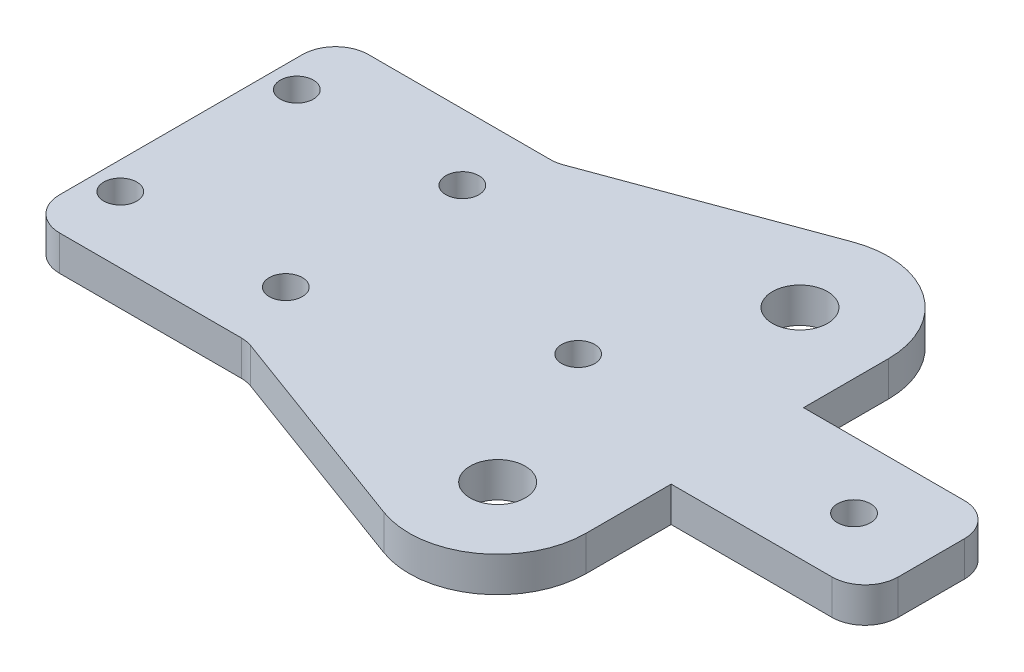
ISO-10303-21;
HEADER;
FILE_DESCRIPTION(('STEP AP214'),'2;1');
FILE_NAME('part.step','',(''),(''),'','','');
FILE_SCHEMA(('AUTOMOTIVE_DESIGN { 1 0 10303 214 1 1 1 1 }'));
ENDSEC;
DATA;
#1=APPLICATION_CONTEXT('core data for automotive mechanical design processes');
#2=APPLICATION_PROTOCOL_DEFINITION('international standard','automotive_design',2000,#1);
#3=PRODUCT_CONTEXT('',#1,'mechanical');
#4=PRODUCT('Part','Part','',(#3));
#5=PRODUCT_RELATED_PRODUCT_CATEGORY('part','',(#4));
#6=PRODUCT_DEFINITION_FORMATION('','',#4);
#7=PRODUCT_DEFINITION_CONTEXT('part definition',#1,'design');
#8=PRODUCT_DEFINITION('design','',#6,#7);
#9=PRODUCT_DEFINITION_SHAPE('','',#8);
#10=(LENGTH_UNIT() NAMED_UNIT(*) SI_UNIT(.MILLI.,.METRE.));
#11=(NAMED_UNIT(*) PLANE_ANGLE_UNIT() SI_UNIT($,.RADIAN.));
#12=(NAMED_UNIT(*) SI_UNIT($,.STERADIAN.) SOLID_ANGLE_UNIT());
#13=UNCERTAINTY_MEASURE_WITH_UNIT(LENGTH_MEASURE(1.E-05),#10,'distance_accuracy_value','');
#14=(GEOMETRIC_REPRESENTATION_CONTEXT(3) GLOBAL_UNCERTAINTY_ASSIGNED_CONTEXT((#13)) GLOBAL_UNIT_ASSIGNED_CONTEXT((#10,
#11,#12)) REPRESENTATION_CONTEXT('',''));
#15=CARTESIAN_POINT('',(0.,0.,0.));
#16=DIRECTION('',(0.,0.,1.));
#17=DIRECTION('',(1.,0.,0.));
#18=AXIS2_PLACEMENT_3D('',#15,#16,#17);
#19=CARTESIAN_POINT('',(42.4,3.175,-13.7));
#20=DIRECTION('',(0.,1.,0.));
#21=DIRECTION('',(0.,0.,1.));
#22=AXIS2_PLACEMENT_3D('',#19,#20,#21);
#23=PLANE('',#22);
#24=CARTESIAN_POINT('',(36.,3.175,0.));
#25=DIRECTION('',(0.,1.,0.));
#26=DIRECTION('',(0.,0.,1.));
#27=AXIS2_PLACEMENT_3D('',#24,#25,#26);
#28=CIRCLE('',#27,1.5);
#29=CARTESIAN_POINT('',(36.,3.175,1.5));
#30=VERTEX_POINT('',#29);
#31=EDGE_CURVE('E361',#30,#30,#28,.T.);
#32=ORIENTED_EDGE('',*,*,#31,.F.);
#33=EDGE_LOOP('',(#32));
#34=FACE_BOUND('',#33,.T.);
#35=CARTESIAN_POINT('',(2.5,3.175,8.));
#36=DIRECTION('',(0.,1.,0.));
#37=DIRECTION('',(0.,0.,1.));
#38=AXIS2_PLACEMENT_3D('',#35,#36,#37);
#39=CIRCLE('',#38,1.5);
#40=CARTESIAN_POINT('',(2.5,3.175,9.5));
#41=VERTEX_POINT('',#40);
#42=EDGE_CURVE('E349',#41,#41,#39,.T.);
#43=ORIENTED_EDGE('',*,*,#42,.F.);
#44=EDGE_LOOP('',(#43));
#45=FACE_BOUND('',#44,.T.);
#46=CARTESIAN_POINT('',(17.5,3.175,-8.));
#47=DIRECTION('',(0.,1.,0.));
#48=DIRECTION('',(0.,0.,1.));
#49=AXIS2_PLACEMENT_3D('',#46,#47,#48);
#50=CIRCLE('',#49,1.5);
#51=CARTESIAN_POINT('',(17.5,3.175,-6.5));
#52=VERTEX_POINT('',#51);
#53=EDGE_CURVE('E337',#52,#52,#50,.T.);
#54=ORIENTED_EDGE('',*,*,#53,.F.);
#55=EDGE_LOOP('',(#54));
#56=FACE_BOUND('',#55,.T.);
#57=CARTESIAN_POINT('',(42.4,3.175,-13.7));
#58=DIRECTION('',(0.,1.,0.));
#59=DIRECTION('',(0.,0.,1.));
#60=AXIS2_PLACEMENT_3D('',#57,#58,#59);
#61=CIRCLE('',#60,2.5);
#62=CARTESIAN_POINT('',(42.4,3.175,-11.2));
#63=VERTEX_POINT('',#62);
#64=EDGE_CURVE('E212',#63,#63,#61,.T.);
#65=ORIENTED_EDGE('',*,*,#64,.F.);
#66=EDGE_LOOP('',(#65));
#67=FACE_BOUND('',#66,.T.);
#68=DIRECTION('',(0.,0.,-1.));
#69=VECTOR('',#68,1.);
#70=CARTESIAN_POINT('',(68.,3.175,-6.));
#71=LINE('',#70,#69);
#72=CARTESIAN_POINT('',(68.,3.175,3.));
#73=VERTEX_POINT('',#72);
#74=CARTESIAN_POINT('',(68.,3.175,-3.));
#75=VERTEX_POINT('',#74);
#76=EDGE_CURVE('E193',#73,#75,#71,.T.);
#77=ORIENTED_EDGE('',*,*,#76,.T.);
#78=CARTESIAN_POINT('',(65.,3.175,-3.));
#79=DIRECTION('',(0.,1.,0.));
#80=DIRECTION('',(0.,0.,1.));
#81=AXIS2_PLACEMENT_3D('',#78,#79,#80);
#82=CIRCLE('',#81,3.);
#83=CARTESIAN_POINT('',(65.,3.175,-6.));
#84=VERTEX_POINT('',#83);
#85=EDGE_CURVE('E270',#75,#84,#82,.T.);
#86=ORIENTED_EDGE('',*,*,#85,.T.);
#87=DIRECTION('',(-1.,0.,0.));
#88=VECTOR('',#87,1.);
#89=CARTESIAN_POINT('',(68.,3.175,-6.));
#90=LINE('',#89,#88);
#91=CARTESIAN_POINT('',(50.425,3.175,-6.));
#92=VERTEX_POINT('',#91);
#93=EDGE_CURVE('E195',#84,#92,#90,.T.);
#94=ORIENTED_EDGE('',*,*,#93,.T.);
#95=DIRECTION('',(0.,0.,-1.));
#96=VECTOR('',#95,1.);
#97=CARTESIAN_POINT('',(50.425,3.175,-13.7));
#98=LINE('',#97,#96);
#99=CARTESIAN_POINT('',(50.425,3.175,-13.7));
#100=VERTEX_POINT('',#99);
#101=EDGE_CURVE('E197',#92,#100,#98,.T.);
#102=ORIENTED_EDGE('',*,*,#101,.T.);
#103=CARTESIAN_POINT('',(42.4,3.175,-13.7));
#104=DIRECTION('',(0.,1.,0.));
#105=DIRECTION('',(0.,0.,1.));
#106=AXIS2_PLACEMENT_3D('',#103,#104,#105);
#107=CIRCLE('',#106,8.025);
#108=CARTESIAN_POINT('',(39.6258235763295,3.175,-21.230243699267));
#109=VERTEX_POINT('',#108);
#110=EDGE_CURVE('E199',#100,#109,#107,.T.);
#111=ORIENTED_EDGE('',*,*,#110,.T.);
#112=DIRECTION('',(-0.938348124519254,0.,0.345691766189474));
#113=VECTOR('',#112,1.);
#114=CARTESIAN_POINT('',(20.,3.175,-14.));
#115=LINE('',#114,#113);
#116=CARTESIAN_POINT('',(20.5020448334781,3.175,-14.1849556264422));
#117=VERTEX_POINT('',#116);
#118=EDGE_CURVE('E201',#109,#117,#115,.T.);
#119=ORIENTED_EDGE('',*,*,#118,.T.);
#120=CARTESIAN_POINT('',(19.4649695349097,3.175,-17.));
#121=DIRECTION('',(0.,1.,0.));
#122=DIRECTION('',(0.,0.,1.));
#123=AXIS2_PLACEMENT_3D('',#120,#121,#122);
#124=CIRCLE('',#123,3.);
#125=CARTESIAN_POINT('',(19.4649695349097,3.175,-14.));
#126=VERTEX_POINT('',#125);
#127=EDGE_CURVE('E11',#117,#126,#124,.F.);
#128=ORIENTED_EDGE('',*,*,#127,.T.);
#129=DIRECTION('',(-1.,0.,0.));
#130=VECTOR('',#129,1.);
#131=CARTESIAN_POINT('',(0.,3.175,-14.));
#132=LINE('',#131,#130);
#133=CARTESIAN_POINT('',(3.,3.175,-14.));
#134=VERTEX_POINT('',#133);
#135=EDGE_CURVE('E204',#126,#134,#132,.T.);
#136=ORIENTED_EDGE('',*,*,#135,.T.);
#137=CARTESIAN_POINT('',(3.,3.175,-11.));
#138=DIRECTION('',(0.,1.,0.));
#139=DIRECTION('',(0.,0.,1.));
#140=AXIS2_PLACEMENT_3D('',#137,#138,#139);
#141=CIRCLE('',#140,3.);
#142=CARTESIAN_POINT('',(0.,3.175,-11.));
#143=VERTEX_POINT('',#142);
#144=EDGE_CURVE('E55',#134,#143,#141,.T.);
#145=ORIENTED_EDGE('',*,*,#144,.T.);
#146=DIRECTION('',(0.,0.,1.));
#147=VECTOR('',#146,1.);
#148=CARTESIAN_POINT('',(0.,3.175,14.));
#149=LINE('',#148,#147);
#150=CARTESIAN_POINT('',(0.,3.175,11.));
#151=VERTEX_POINT('',#150);
#152=EDGE_CURVE('E206',#143,#151,#149,.T.);
#153=ORIENTED_EDGE('',*,*,#152,.T.);
#154=CARTESIAN_POINT('',(3.,3.175,11.));
#155=DIRECTION('',(0.,1.,0.));
#156=DIRECTION('',(0.,0.,1.));
#157=AXIS2_PLACEMENT_3D('',#154,#155,#156);
#158=CIRCLE('',#157,3.);
#159=CARTESIAN_POINT('',(3.,3.175,14.));
#160=VERTEX_POINT('',#159);
#161=EDGE_CURVE('E266',#151,#160,#158,.T.);
#162=ORIENTED_EDGE('',*,*,#161,.T.);
#163=DIRECTION('',(1.,0.,0.));
#164=VECTOR('',#163,1.);
#165=CARTESIAN_POINT('',(20.,3.175,14.));
#166=LINE('',#165,#164);
#167=CARTESIAN_POINT('',(19.4649695349097,3.175,14.));
#168=VERTEX_POINT('',#167);
#169=EDGE_CURVE('E170',#160,#168,#166,.T.);
#170=ORIENTED_EDGE('',*,*,#169,.T.);
#171=CARTESIAN_POINT('',(19.4649695349097,3.175,17.));
#172=DIRECTION('',(0.,1.,0.));
#173=DIRECTION('',(0.,0.,1.));
#174=AXIS2_PLACEMENT_3D('',#171,#172,#173);
#175=CIRCLE('',#174,3.);
#176=CARTESIAN_POINT('',(20.5020448334781,3.175,14.1849556264422));
#177=VERTEX_POINT('',#176);
#178=EDGE_CURVE('E166',#168,#177,#175,.F.);
#179=ORIENTED_EDGE('',*,*,#178,.T.);
#180=DIRECTION('',(0.938348124519254,0.,0.345691766189474));
#181=VECTOR('',#180,1.);
#182=CARTESIAN_POINT('',(20.,3.175,14.));
#183=LINE('',#182,#181);
#184=CARTESIAN_POINT('',(39.6258235763295,3.175,21.230243699267));
#185=VERTEX_POINT('',#184);
#186=EDGE_CURVE('E157',#177,#185,#183,.T.);
#187=ORIENTED_EDGE('',*,*,#186,.T.);
#188=CARTESIAN_POINT('',(42.4,3.175,13.7));
#189=DIRECTION('',(0.,1.,0.));
#190=DIRECTION('',(0.,0.,-1.));
#191=AXIS2_PLACEMENT_3D('',#188,#189,#190);
#192=CIRCLE('',#191,8.025);
#193=CARTESIAN_POINT('',(50.425,3.175,13.7));
#194=VERTEX_POINT('',#193);
#195=EDGE_CURVE('E162',#185,#194,#192,.T.);
#196=ORIENTED_EDGE('',*,*,#195,.T.);
#197=DIRECTION('',(0.,0.,-1.));
#198=VECTOR('',#197,1.);
#199=CARTESIAN_POINT('',(50.425,3.175,6.));
#200=LINE('',#199,#198);
#201=CARTESIAN_POINT('',(50.425,3.175,6.));
#202=VERTEX_POINT('',#201);
#203=EDGE_CURVE('E185',#194,#202,#200,.T.);
#204=ORIENTED_EDGE('',*,*,#203,.T.);
#205=DIRECTION('',(1.,0.,0.));
#206=VECTOR('',#205,1.);
#207=CARTESIAN_POINT('',(68.,3.175,6.));
#208=LINE('',#207,#206);
#209=CARTESIAN_POINT('',(65.,3.175,6.));
#210=VERTEX_POINT('',#209);
#211=EDGE_CURVE('E187',#202,#210,#208,.T.);
#212=ORIENTED_EDGE('',*,*,#211,.T.);
#213=CARTESIAN_POINT('',(65.,3.175,3.));
#214=DIRECTION('',(0.,1.,0.));
#215=DIRECTION('',(0.,0.,1.));
#216=AXIS2_PLACEMENT_3D('',#213,#214,#215);
#217=CIRCLE('',#216,3.);
#218=EDGE_CURVE('E268',#210,#73,#217,.T.);
#219=ORIENTED_EDGE('',*,*,#218,.T.);
#220=EDGE_LOOP('',(#77,#86,#94,#102,#111,#119,#128,#136,#145,#153,#162,#170,#179,#187,#196,#204,
#212,#219));
#221=FACE_BOUND('',#220,.T.);
#222=CARTESIAN_POINT('',(2.5,3.175,-8.));
#223=DIRECTION('',(0.,1.,0.));
#224=DIRECTION('',(0.,0.,1.));
#225=AXIS2_PLACEMENT_3D('',#222,#223,#224);
#226=CIRCLE('',#225,1.5);
#227=CARTESIAN_POINT('',(2.5,3.175,-6.5));
#228=VERTEX_POINT('',#227);
#229=EDGE_CURVE('E331',#228,#228,#226,.T.);
#230=ORIENTED_EDGE('',*,*,#229,.F.);
#231=EDGE_LOOP('',(#230));
#232=FACE_BOUND('',#231,.T.);
#233=CARTESIAN_POINT('',(17.5,3.175,8.));
#234=DIRECTION('',(0.,1.,0.));
#235=DIRECTION('',(0.,0.,1.));
#236=AXIS2_PLACEMENT_3D('',#233,#234,#235);
#237=CIRCLE('',#236,1.5);
#238=CARTESIAN_POINT('',(17.5,3.175,9.5));
#239=VERTEX_POINT('',#238);
#240=EDGE_CURVE('E343',#239,#239,#237,.T.);
#241=ORIENTED_EDGE('',*,*,#240,.F.);
#242=EDGE_LOOP('',(#241));
#243=FACE_BOUND('',#242,.T.);
#244=CARTESIAN_POINT('',(42.4,3.175,13.7));
#245=DIRECTION('',(0.,1.,0.));
#246=DIRECTION('',(0.,0.,-1.));
#247=AXIS2_PLACEMENT_3D('',#244,#245,#246);
#248=CIRCLE('',#247,2.5);
#249=CARTESIAN_POINT('',(42.4,3.175,11.2));
#250=VERTEX_POINT('',#249);
#251=EDGE_CURVE('E355',#250,#250,#248,.T.);
#252=ORIENTED_EDGE('',*,*,#251,.F.);
#253=EDGE_LOOP('',(#252));
#254=FACE_BOUND('',#253,.T.);
#255=CARTESIAN_POINT('',(61.,3.175,0.));
#256=DIRECTION('',(0.,1.,0.));
#257=DIRECTION('',(0.,0.,1.));
#258=AXIS2_PLACEMENT_3D('',#255,#256,#257);
#259=CIRCLE('',#258,1.5);
#260=CARTESIAN_POINT('',(61.,3.175,1.5));
#261=VERTEX_POINT('',#260);
#262=EDGE_CURVE('E367',#261,#261,#259,.T.);
#263=ORIENTED_EDGE('',*,*,#262,.F.);
#264=EDGE_LOOP('',(#263));
#265=FACE_BOUND('',#264,.T.);
#266=ADVANCED_FACE('F33',(#34,#45,#56,#67,#221,#232,#243,#254,#265),#23,.T.);
#267=CARTESIAN_POINT('',(42.4,0.,-13.7));
#268=DIRECTION('',(0.,1.,0.));
#269=DIRECTION('',(0.,0.,1.));
#270=AXIS2_PLACEMENT_3D('',#267,#268,#269);
#271=PLANE('',#270);
#272=DIRECTION('',(-1.,0.,0.));
#273=VECTOR('',#272,1.);
#274=CARTESIAN_POINT('',(68.,0.,-6.));
#275=LINE('',#274,#273);
#276=CARTESIAN_POINT('',(65.,0.,-6.));
#277=VERTEX_POINT('',#276);
#278=CARTESIAN_POINT('',(50.425,0.,-6.));
#279=VERTEX_POINT('',#278);
#280=EDGE_CURVE('E224',#277,#279,#275,.T.);
#281=ORIENTED_EDGE('',*,*,#280,.F.);
#282=CARTESIAN_POINT('',(65.,0.,-3.));
#283=DIRECTION('',(0.,1.,0.));
#284=DIRECTION('',(0.,0.,1.));
#285=AXIS2_PLACEMENT_3D('',#282,#283,#284);
#286=CIRCLE('',#285,3.);
#287=CARTESIAN_POINT('',(68.,0.,-3.));
#288=VERTEX_POINT('',#287);
#289=EDGE_CURVE('E258',#277,#288,#286,.F.);
#290=ORIENTED_EDGE('',*,*,#289,.T.);
#291=DIRECTION('',(0.,0.,-1.));
#292=VECTOR('',#291,1.);
#293=CARTESIAN_POINT('',(68.,0.,-6.));
#294=LINE('',#293,#292);
#295=CARTESIAN_POINT('',(68.,0.,3.));
#296=VERTEX_POINT('',#295);
#297=EDGE_CURVE('E221',#296,#288,#294,.T.);
#298=ORIENTED_EDGE('',*,*,#297,.F.);
#299=CARTESIAN_POINT('',(65.,0.,3.));
#300=DIRECTION('',(0.,1.,0.));
#301=DIRECTION('',(0.,0.,1.));
#302=AXIS2_PLACEMENT_3D('',#299,#300,#301);
#303=CIRCLE('',#302,3.);
#304=CARTESIAN_POINT('',(65.,0.,6.));
#305=VERTEX_POINT('',#304);
#306=EDGE_CURVE('E256',#296,#305,#303,.F.);
#307=ORIENTED_EDGE('',*,*,#306,.T.);
#308=DIRECTION('',(1.,0.,0.));
#309=VECTOR('',#308,1.);
#310=CARTESIAN_POINT('',(68.,0.,6.));
#311=LINE('',#310,#309);
#312=CARTESIAN_POINT('',(50.425,0.,6.));
#313=VERTEX_POINT('',#312);
#314=EDGE_CURVE('E218',#313,#305,#311,.T.);
#315=ORIENTED_EDGE('',*,*,#314,.F.);
#316=DIRECTION('',(0.,0.,-1.));
#317=VECTOR('',#316,1.);
#318=CARTESIAN_POINT('',(50.425,0.,6.));
#319=LINE('',#318,#317);
#320=CARTESIAN_POINT('',(50.425,0.,13.7));
#321=VERTEX_POINT('',#320);
#322=EDGE_CURVE('E216',#321,#313,#319,.T.);
#323=ORIENTED_EDGE('',*,*,#322,.F.);
#324=CARTESIAN_POINT('',(42.4,0.,13.7));
#325=DIRECTION('',(0.,1.,0.));
#326=DIRECTION('',(0.,0.,-1.));
#327=AXIS2_PLACEMENT_3D('',#324,#325,#326);
#328=CIRCLE('',#327,8.025);
#329=CARTESIAN_POINT('',(39.6258235763295,0.,21.230243699267));
#330=VERTEX_POINT('',#329);
#331=EDGE_CURVE('E214',#330,#321,#328,.T.);
#332=ORIENTED_EDGE('',*,*,#331,.F.);
#333=DIRECTION('',(0.938348124519254,0.,0.345691766189474));
#334=VECTOR('',#333,1.);
#335=CARTESIAN_POINT('',(20.,0.,14.));
#336=LINE('',#335,#334);
#337=CARTESIAN_POINT('',(20.5020448334781,0.,14.1849556264422));
#338=VERTEX_POINT('',#337);
#339=EDGE_CURVE('E176',#338,#330,#336,.T.);
#340=ORIENTED_EDGE('',*,*,#339,.F.);
#341=CARTESIAN_POINT('',(19.4649695349097,0.,17.));
#342=DIRECTION('',(0.,1.,0.));
#343=DIRECTION('',(0.,0.,1.));
#344=AXIS2_PLACEMENT_3D('',#341,#342,#343);
#345=CIRCLE('',#344,3.);
#346=CARTESIAN_POINT('',(19.4649695349097,0.,14.));
#347=VERTEX_POINT('',#346);
#348=EDGE_CURVE('E292',#338,#347,#345,.T.);
#349=ORIENTED_EDGE('',*,*,#348,.T.);
#350=DIRECTION('',(1.,0.,0.));
#351=VECTOR('',#350,1.);
#352=CARTESIAN_POINT('',(20.,0.,14.));
#353=LINE('',#352,#351);
#354=CARTESIAN_POINT('',(3.,0.,14.));
#355=VERTEX_POINT('',#354);
#356=EDGE_CURVE('E209',#355,#347,#353,.T.);
#357=ORIENTED_EDGE('',*,*,#356,.F.);
#358=CARTESIAN_POINT('',(3.,0.,11.));
#359=DIRECTION('',(0.,1.,0.));
#360=DIRECTION('',(0.,0.,1.));
#361=AXIS2_PLACEMENT_3D('',#358,#359,#360);
#362=CIRCLE('',#361,3.);
#363=CARTESIAN_POINT('',(0.,0.,11.));
#364=VERTEX_POINT('',#363);
#365=EDGE_CURVE('E254',#355,#364,#362,.F.);
#366=ORIENTED_EDGE('',*,*,#365,.T.);
#367=DIRECTION('',(0.,0.,1.));
#368=VECTOR('',#367,1.);
#369=CARTESIAN_POINT('',(0.,0.,14.));
#370=LINE('',#369,#368);
#371=CARTESIAN_POINT('',(0.,0.,-11.));
#372=VERTEX_POINT('',#371);
#373=EDGE_CURVE('E236',#372,#364,#370,.T.);
#374=ORIENTED_EDGE('',*,*,#373,.F.);
#375=CARTESIAN_POINT('',(3.,0.,-11.));
#376=DIRECTION('',(0.,1.,0.));
#377=DIRECTION('',(0.,0.,1.));
#378=AXIS2_PLACEMENT_3D('',#375,#376,#377);
#379=CIRCLE('',#378,3.);
#380=CARTESIAN_POINT('',(3.,0.,-14.));
#381=VERTEX_POINT('',#380);
#382=EDGE_CURVE('E252',#372,#381,#379,.F.);
#383=ORIENTED_EDGE('',*,*,#382,.T.);
#384=DIRECTION('',(-1.,0.,0.));
#385=VECTOR('',#384,1.);
#386=CARTESIAN_POINT('',(0.,0.,-14.));
#387=LINE('',#386,#385);
#388=CARTESIAN_POINT('',(19.4649695349097,0.,-14.));
#389=VERTEX_POINT('',#388);
#390=EDGE_CURVE('E233',#389,#381,#387,.T.);
#391=ORIENTED_EDGE('',*,*,#390,.F.);
#392=CARTESIAN_POINT('',(19.4649695349097,0.,-17.));
#393=DIRECTION('',(0.,1.,0.));
#394=DIRECTION('',(0.,0.,1.));
#395=AXIS2_PLACEMENT_3D('',#392,#393,#394);
#396=CIRCLE('',#395,3.);
#397=CARTESIAN_POINT('',(20.5020448334781,0.,-14.1849556264422));
#398=VERTEX_POINT('',#397);
#399=EDGE_CURVE('E41',#389,#398,#396,.T.);
#400=ORIENTED_EDGE('',*,*,#399,.T.);
#401=DIRECTION('',(-0.938348124519254,0.,0.345691766189474));
#402=VECTOR('',#401,1.);
#403=CARTESIAN_POINT('',(20.,0.,-14.));
#404=LINE('',#403,#402);
#405=CARTESIAN_POINT('',(39.6258235763295,0.,-21.230243699267));
#406=VERTEX_POINT('',#405);
#407=EDGE_CURVE('E230',#406,#398,#404,.T.);
#408=ORIENTED_EDGE('',*,*,#407,.F.);
#409=CARTESIAN_POINT('',(42.4,0.,-13.7));
#410=DIRECTION('',(0.,1.,0.));
#411=DIRECTION('',(0.,0.,1.));
#412=AXIS2_PLACEMENT_3D('',#409,#410,#411);
#413=CIRCLE('',#412,8.025);
#414=CARTESIAN_POINT('',(50.425,0.,-13.7));
#415=VERTEX_POINT('',#414);
#416=EDGE_CURVE('E228',#415,#406,#413,.T.);
#417=ORIENTED_EDGE('',*,*,#416,.F.);
#418=DIRECTION('',(0.,0.,-1.));
#419=VECTOR('',#418,1.);
#420=CARTESIAN_POINT('',(50.425,0.,-13.7));
#421=LINE('',#420,#419);
#422=EDGE_CURVE('E226',#279,#415,#421,.T.);
#423=ORIENTED_EDGE('',*,*,#422,.F.);
#424=EDGE_LOOP('',(#281,#290,#298,#307,#315,#323,#332,#340,#349,#357,#366,#374,#383,#391,#400,
#408,#417,#423));
#425=FACE_BOUND('',#424,.T.);
#426=CARTESIAN_POINT('',(42.4,0.,-13.7));
#427=DIRECTION('',(0.,1.,0.));
#428=DIRECTION('',(0.,0.,1.));
#429=AXIS2_PLACEMENT_3D('',#426,#427,#428);
#430=CIRCLE('',#429,2.5);
#431=CARTESIAN_POINT('',(42.4,0.,-11.2));
#432=VERTEX_POINT('',#431);
#433=EDGE_CURVE('E328',#432,#432,#430,.T.);
#434=ORIENTED_EDGE('',*,*,#433,.T.);
#435=EDGE_LOOP('',(#434));
#436=FACE_BOUND('',#435,.T.);
#437=CARTESIAN_POINT('',(2.5,0.,-8.));
#438=DIRECTION('',(0.,1.,0.));
#439=DIRECTION('',(0.,0.,1.));
#440=AXIS2_PLACEMENT_3D('',#437,#438,#439);
#441=CIRCLE('',#440,1.5);
#442=CARTESIAN_POINT('',(2.5,0.,-6.5));
#443=VERTEX_POINT('',#442);
#444=EDGE_CURVE('E334',#443,#443,#441,.T.);
#445=ORIENTED_EDGE('',*,*,#444,.T.);
#446=EDGE_LOOP('',(#445));
#447=FACE_BOUND('',#446,.T.);
#448=CARTESIAN_POINT('',(17.5,0.,-8.));
#449=DIRECTION('',(0.,1.,0.));
#450=DIRECTION('',(0.,0.,1.));
#451=AXIS2_PLACEMENT_3D('',#448,#449,#450);
#452=CIRCLE('',#451,1.5);
#453=CARTESIAN_POINT('',(17.5,0.,-6.5));
#454=VERTEX_POINT('',#453);
#455=EDGE_CURVE('E340',#454,#454,#452,.T.);
#456=ORIENTED_EDGE('',*,*,#455,.T.);
#457=EDGE_LOOP('',(#456));
#458=FACE_BOUND('',#457,.T.);
#459=CARTESIAN_POINT('',(17.5,0.,8.));
#460=DIRECTION('',(0.,1.,0.));
#461=DIRECTION('',(0.,0.,1.));
#462=AXIS2_PLACEMENT_3D('',#459,#460,#461);
#463=CIRCLE('',#462,1.5);
#464=CARTESIAN_POINT('',(17.5,0.,9.5));
#465=VERTEX_POINT('',#464);
#466=EDGE_CURVE('E346',#465,#465,#463,.T.);
#467=ORIENTED_EDGE('',*,*,#466,.T.);
#468=EDGE_LOOP('',(#467));
#469=FACE_BOUND('',#468,.T.);
#470=CARTESIAN_POINT('',(2.5,0.,8.));
#471=DIRECTION('',(0.,1.,0.));
#472=DIRECTION('',(0.,0.,1.));
#473=AXIS2_PLACEMENT_3D('',#470,#471,#472);
#474=CIRCLE('',#473,1.5);
#475=CARTESIAN_POINT('',(2.5,0.,9.5));
#476=VERTEX_POINT('',#475);
#477=EDGE_CURVE('E352',#476,#476,#474,.T.);
#478=ORIENTED_EDGE('',*,*,#477,.T.);
#479=EDGE_LOOP('',(#478));
#480=FACE_BOUND('',#479,.T.);
#481=CARTESIAN_POINT('',(42.4,0.,13.7));
#482=DIRECTION('',(0.,1.,0.));
#483=DIRECTION('',(0.,0.,-1.));
#484=AXIS2_PLACEMENT_3D('',#481,#482,#483);
#485=CIRCLE('',#484,2.5);
#486=CARTESIAN_POINT('',(42.4,0.,11.2));
#487=VERTEX_POINT('',#486);
#488=EDGE_CURVE('E358',#487,#487,#485,.T.);
#489=ORIENTED_EDGE('',*,*,#488,.T.);
#490=EDGE_LOOP('',(#489));
#491=FACE_BOUND('',#490,.T.);
#492=CARTESIAN_POINT('',(36.,0.,0.));
#493=DIRECTION('',(0.,1.,0.));
#494=DIRECTION('',(0.,0.,1.));
#495=AXIS2_PLACEMENT_3D('',#492,#493,#494);
#496=CIRCLE('',#495,1.5);
#497=CARTESIAN_POINT('',(36.,0.,1.5));
#498=VERTEX_POINT('',#497);
#499=EDGE_CURVE('E364',#498,#498,#496,.T.);
#500=ORIENTED_EDGE('',*,*,#499,.T.);
#501=EDGE_LOOP('',(#500));
#502=FACE_BOUND('',#501,.T.);
#503=CARTESIAN_POINT('',(61.,0.,0.));
#504=DIRECTION('',(0.,1.,0.));
#505=DIRECTION('',(0.,0.,1.));
#506=AXIS2_PLACEMENT_3D('',#503,#504,#505);
#507=CIRCLE('',#506,1.5);
#508=CARTESIAN_POINT('',(61.,0.,1.5));
#509=VERTEX_POINT('',#508);
#510=EDGE_CURVE('E370',#509,#509,#507,.T.);
#511=ORIENTED_EDGE('',*,*,#510,.T.);
#512=EDGE_LOOP('',(#511));
#513=FACE_BOUND('',#512,.T.);
#514=ADVANCED_FACE('F298',(#425,#436,#447,#458,#469,#480,#491,#502,#513),#271,.F.);
#515=CARTESIAN_POINT('',(20.,3.175,14.));
#516=DIRECTION('',(0.,0.,-1.));
#517=DIRECTION('',(-1.,0.,0.));
#518=AXIS2_PLACEMENT_3D('',#515,#516,#517);
#519=PLANE('',#518);
#520=ORIENTED_EDGE('',*,*,#356,.T.);
#521=DIRECTION('',(0.,-1.,0.));
#522=VECTOR('',#521,1.);
#523=CARTESIAN_POINT('',(19.4649695349097,3.175,14.));
#524=LINE('',#523,#522);
#525=EDGE_CURVE('E279',#347,#168,#524,.F.);
#526=ORIENTED_EDGE('',*,*,#525,.T.);
#527=ORIENTED_EDGE('',*,*,#169,.F.);
#528=DIRECTION('',(0.,-1.,0.));
#529=VECTOR('',#528,1.);
#530=CARTESIAN_POINT('',(3.,3.175,14.));
#531=LINE('',#530,#529);
#532=EDGE_CURVE('E276',#160,#355,#531,.T.);
#533=ORIENTED_EDGE('',*,*,#532,.T.);
#534=EDGE_LOOP('',(#520,#526,#527,#533));
#535=FACE_BOUND('',#534,.T.);
#536=ADVANCED_FACE('F325',(#535),#519,.F.);
#537=CARTESIAN_POINT('',(20.,3.175,14.));
#538=DIRECTION('',(0.345691766189474,0.,-0.938348124519254));
#539=DIRECTION('',(-0.938348124519254,0.,-0.345691766189474));
#540=AXIS2_PLACEMENT_3D('',#537,#538,#539);
#541=PLANE('',#540);
#542=ORIENTED_EDGE('',*,*,#186,.F.);
#543=DIRECTION('',(0.,-1.,0.));
#544=VECTOR('',#543,1.);
#545=CARTESIAN_POINT('',(20.5020448334781,0.,14.1849556264422));
#546=LINE('',#545,#544);
#547=EDGE_CURVE('E274',#177,#338,#546,.T.);
#548=ORIENTED_EDGE('',*,*,#547,.T.);
#549=ORIENTED_EDGE('',*,*,#339,.T.);
#550=DIRECTION('',(0.,-1.,0.));
#551=VECTOR('',#550,1.);
#552=CARTESIAN_POINT('',(39.6258235763295,3.175,21.230243699267));
#553=LINE('',#552,#551);
#554=EDGE_CURVE('E173',#185,#330,#553,.T.);
#555=ORIENTED_EDGE('',*,*,#554,.F.);
#556=EDGE_LOOP('',(#542,#548,#549,#555));
#557=FACE_BOUND('',#556,.T.);
#558=ADVANCED_FACE('F174',(#557),#541,.F.);
#559=CARTESIAN_POINT('',(42.4,3.175,13.7));
#560=DIRECTION('',(0.,-1.,0.));
#561=DIRECTION('',(0.,0.,-1.));
#562=AXIS2_PLACEMENT_3D('',#559,#560,#561);
#563=CYLINDRICAL_SURFACE('',#562,8.025);
#564=ORIENTED_EDGE('',*,*,#331,.T.);
#565=DIRECTION('',(0.,-1.,0.));
#566=VECTOR('',#565,1.);
#567=CARTESIAN_POINT('',(50.425,3.175,13.7));
#568=LINE('',#567,#566);
#569=EDGE_CURVE('E180',#194,#321,#568,.T.);
#570=ORIENTED_EDGE('',*,*,#569,.F.);
#571=ORIENTED_EDGE('',*,*,#195,.F.);
#572=ORIENTED_EDGE('',*,*,#554,.T.);
#573=EDGE_LOOP('',(#564,#570,#571,#572));
#574=FACE_BOUND('',#573,.T.);
#575=ADVANCED_FACE('F182',(#574),#563,.T.);
#576=CARTESIAN_POINT('',(50.425,3.175,6.));
#577=DIRECTION('',(-1.,0.,0.));
#578=DIRECTION('',(0.,0.,1.));
#579=AXIS2_PLACEMENT_3D('',#576,#577,#578);
#580=PLANE('',#579);
#581=ORIENTED_EDGE('',*,*,#322,.T.);
#582=DIRECTION('',(0.,-1.,0.));
#583=VECTOR('',#582,1.);
#584=CARTESIAN_POINT('',(50.425,3.175,6.));
#585=LINE('',#584,#583);
#586=EDGE_CURVE('E246',#202,#313,#585,.T.);
#587=ORIENTED_EDGE('',*,*,#586,.F.);
#588=ORIENTED_EDGE('',*,*,#203,.F.);
#589=ORIENTED_EDGE('',*,*,#569,.T.);
#590=EDGE_LOOP('',(#581,#587,#588,#589));
#591=FACE_BOUND('',#590,.T.);
#592=ADVANCED_FACE('F417',(#591),#580,.F.);
#593=CARTESIAN_POINT('',(68.,3.175,6.));
#594=DIRECTION('',(0.,0.,-1.));
#595=DIRECTION('',(-1.,0.,0.));
#596=AXIS2_PLACEMENT_3D('',#593,#594,#595);
#597=PLANE('',#596);
#598=ORIENTED_EDGE('',*,*,#314,.T.);
#599=DIRECTION('',(0.,-1.,0.));
#600=VECTOR('',#599,1.);
#601=CARTESIAN_POINT('',(65.,3.175,6.));
#602=LINE('',#601,#600);
#603=EDGE_CURVE('E272',#305,#210,#602,.F.);
#604=ORIENTED_EDGE('',*,*,#603,.T.);
#605=ORIENTED_EDGE('',*,*,#211,.F.);
#606=ORIENTED_EDGE('',*,*,#586,.T.);
#607=EDGE_LOOP('',(#598,#604,#605,#606));
#608=FACE_BOUND('',#607,.T.);
#609=ADVANCED_FACE('F413',(#608),#597,.F.);
#610=CARTESIAN_POINT('',(68.,3.175,-6.));
#611=DIRECTION('',(-1.,0.,0.));
#612=DIRECTION('',(0.,0.,1.));
#613=AXIS2_PLACEMENT_3D('',#610,#611,#612);
#614=PLANE('',#613);
#615=ORIENTED_EDGE('',*,*,#297,.T.);
#616=DIRECTION('',(0.,-1.,0.));
#617=VECTOR('',#616,1.);
#618=CARTESIAN_POINT('',(68.,3.175,-3.));
#619=LINE('',#618,#617);
#620=EDGE_CURVE('E263',#288,#75,#619,.F.);
#621=ORIENTED_EDGE('',*,*,#620,.T.);
#622=ORIENTED_EDGE('',*,*,#76,.F.);
#623=DIRECTION('',(0.,-1.,0.));
#624=VECTOR('',#623,1.);
#625=CARTESIAN_POINT('',(68.,3.175,3.));
#626=LINE('',#625,#624);
#627=EDGE_CURVE('E260',#73,#296,#626,.T.);
#628=ORIENTED_EDGE('',*,*,#627,.T.);
#629=EDGE_LOOP('',(#615,#621,#622,#628));
#630=FACE_BOUND('',#629,.T.);
#631=ADVANCED_FACE('F409',(#630),#614,.F.);
#632=CARTESIAN_POINT('',(68.,3.175,-6.));
#633=DIRECTION('',(0.,0.,1.));
#634=DIRECTION('',(1.,0.,0.));
#635=AXIS2_PLACEMENT_3D('',#632,#633,#634);
#636=PLANE('',#635);
#637=ORIENTED_EDGE('',*,*,#93,.F.);
#638=DIRECTION('',(0.,-1.,0.));
#639=VECTOR('',#638,1.);
#640=CARTESIAN_POINT('',(65.,3.175,-6.));
#641=LINE('',#640,#639);
#642=EDGE_CURVE('E179',#84,#277,#641,.T.);
#643=ORIENTED_EDGE('',*,*,#642,.T.);
#644=ORIENTED_EDGE('',*,*,#280,.T.);
#645=DIRECTION('',(0.,-1.,0.));
#646=VECTOR('',#645,1.);
#647=CARTESIAN_POINT('',(50.425,3.175,-6.));
#648=LINE('',#647,#646);
#649=EDGE_CURVE('E243',#92,#279,#648,.T.);
#650=ORIENTED_EDGE('',*,*,#649,.F.);
#651=EDGE_LOOP('',(#637,#643,#644,#650));
#652=FACE_BOUND('',#651,.T.);
#653=ADVANCED_FACE('F405',(#652),#636,.F.);
#654=CARTESIAN_POINT('',(50.425,3.175,-13.7));
#655=DIRECTION('',(-1.,0.,0.));
#656=DIRECTION('',(0.,0.,1.));
#657=AXIS2_PLACEMENT_3D('',#654,#655,#656);
#658=PLANE('',#657);
#659=ORIENTED_EDGE('',*,*,#422,.T.);
#660=DIRECTION('',(0.,-1.,0.));
#661=VECTOR('',#660,1.);
#662=CARTESIAN_POINT('',(50.425,3.175,-13.7));
#663=LINE('',#662,#661);
#664=EDGE_CURVE('E240',#100,#415,#663,.T.);
#665=ORIENTED_EDGE('',*,*,#664,.F.);
#666=ORIENTED_EDGE('',*,*,#101,.F.);
#667=ORIENTED_EDGE('',*,*,#649,.T.);
#668=EDGE_LOOP('',(#659,#665,#666,#667));
#669=FACE_BOUND('',#668,.T.);
#670=ADVANCED_FACE('F401',(#669),#658,.F.);
#671=CARTESIAN_POINT('',(42.4,3.175,-13.7));
#672=DIRECTION('',(0.,-1.,0.));
#673=DIRECTION('',(0.,0.,-1.));
#674=AXIS2_PLACEMENT_3D('',#671,#672,#673);
#675=CYLINDRICAL_SURFACE('',#674,8.025);
#676=ORIENTED_EDGE('',*,*,#416,.T.);
#677=DIRECTION('',(0.,-1.,0.));
#678=VECTOR('',#677,1.);
#679=CARTESIAN_POINT('',(39.6258235763295,3.175,-21.230243699267));
#680=LINE('',#679,#678);
#681=EDGE_CURVE('E208',#109,#406,#680,.T.);
#682=ORIENTED_EDGE('',*,*,#681,.F.);
#683=ORIENTED_EDGE('',*,*,#110,.F.);
#684=ORIENTED_EDGE('',*,*,#664,.T.);
#685=EDGE_LOOP('',(#676,#682,#683,#684));
#686=FACE_BOUND('',#685,.T.);
#687=ADVANCED_FACE('F398',(#686),#675,.T.);
#688=CARTESIAN_POINT('',(20.,3.175,-14.));
#689=DIRECTION('',(0.345691766189474,0.,0.938348124519254));
#690=DIRECTION('',(0.938348124519254,0.,-0.345691766189474));
#691=AXIS2_PLACEMENT_3D('',#688,#689,#690);
#692=PLANE('',#691);
#693=ORIENTED_EDGE('',*,*,#407,.T.);
#694=DIRECTION('',(0.,-1.,0.));
#695=VECTOR('',#694,1.);
#696=CARTESIAN_POINT('',(20.5020448334781,3.175,-14.1849556264422));
#697=LINE('',#696,#695);
#698=EDGE_CURVE('E286',#398,#117,#697,.F.);
#699=ORIENTED_EDGE('',*,*,#698,.T.);
#700=ORIENTED_EDGE('',*,*,#118,.F.);
#701=ORIENTED_EDGE('',*,*,#681,.T.);
#702=EDGE_LOOP('',(#693,#699,#700,#701));
#703=FACE_BOUND('',#702,.T.);
#704=ADVANCED_FACE('F305',(#703),#692,.F.);
#705=CARTESIAN_POINT('',(0.,3.175,-14.));
#706=DIRECTION('',(0.,0.,1.));
#707=DIRECTION('',(1.,0.,0.));
#708=AXIS2_PLACEMENT_3D('',#705,#706,#707);
#709=PLANE('',#708);
#710=ORIENTED_EDGE('',*,*,#135,.F.);
#711=DIRECTION('',(0.,-1.,0.));
#712=VECTOR('',#711,1.);
#713=CARTESIAN_POINT('',(19.4649695349097,0.,-14.));
#714=LINE('',#713,#712);
#715=EDGE_CURVE('E283',#126,#389,#714,.T.);
#716=ORIENTED_EDGE('',*,*,#715,.T.);
#717=ORIENTED_EDGE('',*,*,#390,.T.);
#718=DIRECTION('',(0.,-1.,0.));
#719=VECTOR('',#718,1.);
#720=CARTESIAN_POINT('',(3.,3.175,-14.));
#721=LINE('',#720,#719);
#722=EDGE_CURVE('E281',#381,#134,#721,.F.);
#723=ORIENTED_EDGE('',*,*,#722,.T.);
#724=EDGE_LOOP('',(#710,#716,#717,#723));
#725=FACE_BOUND('',#724,.T.);
#726=ADVANCED_FACE('F312',(#725),#709,.F.);
#727=CARTESIAN_POINT('',(0.,3.175,14.));
#728=DIRECTION('',(1.,0.,0.));
#729=DIRECTION('',(0.,0.,-1.));
#730=AXIS2_PLACEMENT_3D('',#727,#728,#729);
#731=PLANE('',#730);
#732=ORIENTED_EDGE('',*,*,#373,.T.);
#733=DIRECTION('',(0.,-1.,0.));
#734=VECTOR('',#733,1.);
#735=CARTESIAN_POINT('',(0.,3.175,11.));
#736=LINE('',#735,#734);
#737=EDGE_CURVE('E48',#364,#151,#736,.F.);
#738=ORIENTED_EDGE('',*,*,#737,.T.);
#739=ORIENTED_EDGE('',*,*,#152,.F.);
#740=DIRECTION('',(0.,-1.,0.));
#741=VECTOR('',#740,1.);
#742=CARTESIAN_POINT('',(0.,3.175,-11.));
#743=LINE('',#742,#741);
#744=EDGE_CURVE('E288',#143,#372,#743,.T.);
#745=ORIENTED_EDGE('',*,*,#744,.T.);
#746=EDGE_LOOP('',(#732,#738,#739,#745));
#747=FACE_BOUND('',#746,.T.);
#748=ADVANCED_FACE('F317',(#747),#731,.F.);
#749=CARTESIAN_POINT('',(42.4,3.175,-13.7));
#750=DIRECTION('',(0.,-1.,0.));
#751=DIRECTION('',(0.,0.,-1.));
#752=AXIS2_PLACEMENT_3D('',#749,#750,#751);
#753=CYLINDRICAL_SURFACE('',#752,2.5);
#754=ORIENTED_EDGE('',*,*,#64,.T.);
#755=EDGE_LOOP('',(#754));
#756=FACE_BOUND('',#755,.T.);
#757=ORIENTED_EDGE('',*,*,#433,.F.);
#758=EDGE_LOOP('',(#757));
#759=FACE_BOUND('',#758,.T.);
#760=ADVANCED_FACE('F389',(#756,#759),#753,.F.);
#761=CARTESIAN_POINT('',(2.5,3.175,-8.));
#762=DIRECTION('',(0.,-1.,0.));
#763=DIRECTION('',(0.,0.,-1.));
#764=AXIS2_PLACEMENT_3D('',#761,#762,#763);
#765=CYLINDRICAL_SURFACE('',#764,1.5);
#766=ORIENTED_EDGE('',*,*,#229,.T.);
#767=EDGE_LOOP('',(#766));
#768=FACE_BOUND('',#767,.T.);
#769=ORIENTED_EDGE('',*,*,#444,.F.);
#770=EDGE_LOOP('',(#769));
#771=FACE_BOUND('',#770,.T.);
#772=ADVANCED_FACE('F597',(#768,#771),#765,.F.);
#773=CARTESIAN_POINT('',(17.5,3.175,-8.));
#774=DIRECTION('',(0.,-1.,0.));
#775=DIRECTION('',(0.,0.,-1.));
#776=AXIS2_PLACEMENT_3D('',#773,#774,#775);
#777=CYLINDRICAL_SURFACE('',#776,1.5);
#778=ORIENTED_EDGE('',*,*,#53,.T.);
#779=EDGE_LOOP('',(#778));
#780=FACE_BOUND('',#779,.T.);
#781=ORIENTED_EDGE('',*,*,#455,.F.);
#782=EDGE_LOOP('',(#781));
#783=FACE_BOUND('',#782,.T.);
#784=ADVANCED_FACE('F587',(#780,#783),#777,.F.);
#785=CARTESIAN_POINT('',(17.5,3.175,8.));
#786=DIRECTION('',(0.,-1.,0.));
#787=DIRECTION('',(0.,0.,-1.));
#788=AXIS2_PLACEMENT_3D('',#785,#786,#787);
#789=CYLINDRICAL_SURFACE('',#788,1.5);
#790=ORIENTED_EDGE('',*,*,#240,.T.);
#791=EDGE_LOOP('',(#790));
#792=FACE_BOUND('',#791,.T.);
#793=ORIENTED_EDGE('',*,*,#466,.F.);
#794=EDGE_LOOP('',(#793));
#795=FACE_BOUND('',#794,.T.);
#796=ADVANCED_FACE('F577',(#792,#795),#789,.F.);
#797=CARTESIAN_POINT('',(2.5,3.175,8.));
#798=DIRECTION('',(0.,-1.,0.));
#799=DIRECTION('',(0.,0.,-1.));
#800=AXIS2_PLACEMENT_3D('',#797,#798,#799);
#801=CYLINDRICAL_SURFACE('',#800,1.5);
#802=ORIENTED_EDGE('',*,*,#42,.T.);
#803=EDGE_LOOP('',(#802));
#804=FACE_BOUND('',#803,.T.);
#805=ORIENTED_EDGE('',*,*,#477,.F.);
#806=EDGE_LOOP('',(#805));
#807=FACE_BOUND('',#806,.T.);
#808=ADVANCED_FACE('F567',(#804,#807),#801,.F.);
#809=CARTESIAN_POINT('',(42.4,3.175,13.7));
#810=DIRECTION('',(0.,-1.,0.));
#811=DIRECTION('',(0.,0.,-1.));
#812=AXIS2_PLACEMENT_3D('',#809,#810,#811);
#813=CYLINDRICAL_SURFACE('',#812,2.5);
#814=ORIENTED_EDGE('',*,*,#251,.T.);
#815=EDGE_LOOP('',(#814));
#816=FACE_BOUND('',#815,.T.);
#817=ORIENTED_EDGE('',*,*,#488,.F.);
#818=EDGE_LOOP('',(#817));
#819=FACE_BOUND('',#818,.T.);
#820=ADVANCED_FACE('F557',(#816,#819),#813,.F.);
#821=CARTESIAN_POINT('',(36.,3.175,0.));
#822=DIRECTION('',(0.,-1.,0.));
#823=DIRECTION('',(0.,0.,-1.));
#824=AXIS2_PLACEMENT_3D('',#821,#822,#823);
#825=CYLINDRICAL_SURFACE('',#824,1.5);
#826=ORIENTED_EDGE('',*,*,#31,.T.);
#827=EDGE_LOOP('',(#826));
#828=FACE_BOUND('',#827,.T.);
#829=ORIENTED_EDGE('',*,*,#499,.F.);
#830=EDGE_LOOP('',(#829));
#831=FACE_BOUND('',#830,.T.);
#832=ADVANCED_FACE('F548',(#828,#831),#825,.F.);
#833=CARTESIAN_POINT('',(61.,3.175,0.));
#834=DIRECTION('',(0.,-1.,0.));
#835=DIRECTION('',(0.,0.,-1.));
#836=AXIS2_PLACEMENT_3D('',#833,#834,#835);
#837=CYLINDRICAL_SURFACE('',#836,1.5);
#838=ORIENTED_EDGE('',*,*,#262,.T.);
#839=EDGE_LOOP('',(#838));
#840=FACE_BOUND('',#839,.T.);
#841=ORIENTED_EDGE('',*,*,#510,.F.);
#842=EDGE_LOOP('',(#841));
#843=FACE_BOUND('',#842,.T.);
#844=ADVANCED_FACE('F376',(#840,#843),#837,.F.);
#845=CARTESIAN_POINT('',(65.,3.175,-3.));
#846=DIRECTION('',(0.,-1.,0.));
#847=DIRECTION('',(0.,0.,-1.));
#848=AXIS2_PLACEMENT_3D('',#845,#846,#847);
#849=CYLINDRICAL_SURFACE('',#848,3.);
#850=ORIENTED_EDGE('',*,*,#85,.F.);
#851=ORIENTED_EDGE('',*,*,#620,.F.);
#852=ORIENTED_EDGE('',*,*,#289,.F.);
#853=ORIENTED_EDGE('',*,*,#642,.F.);
#854=EDGE_LOOP('',(#850,#851,#852,#853));
#855=FACE_BOUND('',#854,.T.);
#856=ADVANCED_FACE('F428',(#855),#849,.T.);
#857=CARTESIAN_POINT('',(65.,3.175,3.));
#858=DIRECTION('',(0.,-1.,0.));
#859=DIRECTION('',(0.,0.,-1.));
#860=AXIS2_PLACEMENT_3D('',#857,#858,#859);
#861=CYLINDRICAL_SURFACE('',#860,3.);
#862=ORIENTED_EDGE('',*,*,#218,.F.);
#863=ORIENTED_EDGE('',*,*,#603,.F.);
#864=ORIENTED_EDGE('',*,*,#306,.F.);
#865=ORIENTED_EDGE('',*,*,#627,.F.);
#866=EDGE_LOOP('',(#862,#863,#864,#865));
#867=FACE_BOUND('',#866,.T.);
#868=ADVANCED_FACE('F431',(#867),#861,.T.);
#869=CARTESIAN_POINT('',(19.4649695349097,3.175,17.));
#870=DIRECTION('',(0.,1.,0.));
#871=DIRECTION('',(0.,0.,1.));
#872=AXIS2_PLACEMENT_3D('',#869,#870,#871);
#873=CYLINDRICAL_SURFACE('',#872,3.);
#874=ORIENTED_EDGE('',*,*,#178,.F.);
#875=ORIENTED_EDGE('',*,*,#525,.F.);
#876=ORIENTED_EDGE('',*,*,#348,.F.);
#877=ORIENTED_EDGE('',*,*,#547,.F.);
#878=EDGE_LOOP('',(#874,#875,#876,#877));
#879=FACE_BOUND('',#878,.T.);
#880=ADVANCED_FACE('F435',(#879),#873,.F.);
#881=CARTESIAN_POINT('',(19.4649695349097,3.175,-17.));
#882=DIRECTION('',(0.,1.,0.));
#883=DIRECTION('',(0.,0.,1.));
#884=AXIS2_PLACEMENT_3D('',#881,#882,#883);
#885=CYLINDRICAL_SURFACE('',#884,3.);
#886=ORIENTED_EDGE('',*,*,#127,.F.);
#887=ORIENTED_EDGE('',*,*,#698,.F.);
#888=ORIENTED_EDGE('',*,*,#399,.F.);
#889=ORIENTED_EDGE('',*,*,#715,.F.);
#890=EDGE_LOOP('',(#886,#887,#888,#889));
#891=FACE_BOUND('',#890,.T.);
#892=ADVANCED_FACE('F309',(#891),#885,.F.);
#893=CARTESIAN_POINT('',(3.,3.175,11.));
#894=DIRECTION('',(0.,-1.,0.));
#895=DIRECTION('',(0.,0.,-1.));
#896=AXIS2_PLACEMENT_3D('',#893,#894,#895);
#897=CYLINDRICAL_SURFACE('',#896,3.);
#898=ORIENTED_EDGE('',*,*,#161,.F.);
#899=ORIENTED_EDGE('',*,*,#737,.F.);
#900=ORIENTED_EDGE('',*,*,#365,.F.);
#901=ORIENTED_EDGE('',*,*,#532,.F.);
#902=EDGE_LOOP('',(#898,#899,#900,#901));
#903=FACE_BOUND('',#902,.T.);
#904=ADVANCED_FACE('F322',(#903),#897,.T.);
#905=CARTESIAN_POINT('',(3.,3.175,-11.));
#906=DIRECTION('',(0.,-1.,0.));
#907=DIRECTION('',(0.,0.,-1.));
#908=AXIS2_PLACEMENT_3D('',#905,#906,#907);
#909=CYLINDRICAL_SURFACE('',#908,3.);
#910=ORIENTED_EDGE('',*,*,#144,.F.);
#911=ORIENTED_EDGE('',*,*,#722,.F.);
#912=ORIENTED_EDGE('',*,*,#382,.F.);
#913=ORIENTED_EDGE('',*,*,#744,.F.);
#914=EDGE_LOOP('',(#910,#911,#912,#913));
#915=FACE_BOUND('',#914,.T.);
#916=ADVANCED_FACE('F35',(#915),#909,.T.);
#917=CLOSED_SHELL('',(#266,#514,#536,#558,#575,#592,#609,#631,#653,#670,#687,#704,#726,#748,
#760,#772,#784,#796,#808,#820,#832,#844,#856,#868,#880,#892,#904,#916));
#918=MANIFOLD_SOLID_BREP('B2',#917);
#919=ADVANCED_BREP_SHAPE_REPRESENTATION('',(#18,#918),#14);
#920=SHAPE_DEFINITION_REPRESENTATION(#9,#919);
ENDSEC;
END-ISO-10303-21;
